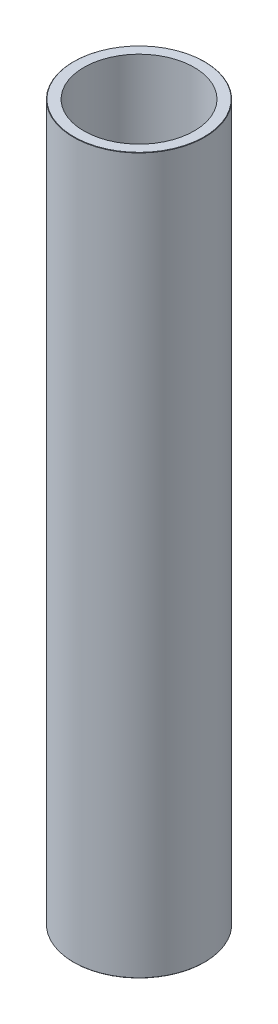
ISO-10303-21;
HEADER;
FILE_DESCRIPTION(('STEP AP214'),'2;1');
FILE_NAME('part.step','',(''),(''),'','','');
FILE_SCHEMA(('AUTOMOTIVE_DESIGN { 1 0 10303 214 1 1 1 1 }'));
ENDSEC;
DATA;
#1=APPLICATION_CONTEXT('core data for automotive mechanical design processes');
#2=APPLICATION_PROTOCOL_DEFINITION('international standard','automotive_design',2000,#1);
#3=PRODUCT_CONTEXT('',#1,'mechanical');
#4=PRODUCT('Part','Part','',(#3));
#5=PRODUCT_RELATED_PRODUCT_CATEGORY('part','',(#4));
#6=PRODUCT_DEFINITION_FORMATION('','',#4);
#7=PRODUCT_DEFINITION_CONTEXT('part definition',#1,'design');
#8=PRODUCT_DEFINITION('design','',#6,#7);
#9=PRODUCT_DEFINITION_SHAPE('','',#8);
#10=(LENGTH_UNIT() NAMED_UNIT(*) SI_UNIT(.MILLI.,.METRE.));
#11=(NAMED_UNIT(*) PLANE_ANGLE_UNIT() SI_UNIT($,.RADIAN.));
#12=(NAMED_UNIT(*) SI_UNIT($,.STERADIAN.) SOLID_ANGLE_UNIT());
#13=UNCERTAINTY_MEASURE_WITH_UNIT(LENGTH_MEASURE(1.E-05),#10,'distance_accuracy_value','');
#14=(GEOMETRIC_REPRESENTATION_CONTEXT(3) GLOBAL_UNCERTAINTY_ASSIGNED_CONTEXT((#13)) GLOBAL_UNIT_ASSIGNED_CONTEXT((#10,
#11,#12)) REPRESENTATION_CONTEXT('',''));
#15=CARTESIAN_POINT('',(0.,0.,0.));
#16=DIRECTION('',(0.,0.,1.));
#17=DIRECTION('',(1.,0.,0.));
#18=AXIS2_PLACEMENT_3D('',#15,#16,#17);
#19=CARTESIAN_POINT('',(0.,600.,0.));
#20=DIRECTION('',(0.,-1.,0.));
#21=DIRECTION('',(0.,0.,-1.));
#22=AXIS2_PLACEMENT_3D('',#19,#20,#21);
#23=CYLINDRICAL_SURFACE('',#22,55.);
#24=CARTESIAN_POINT('',(0.,599.766328907678,0.));
#25=DIRECTION('',(0.,1.,0.));
#26=DIRECTION('',(0.,0.,1.));
#27=AXIS2_PLACEMENT_3D('',#24,#25,#26);
#28=CIRCLE('',#27,55.);
#29=CARTESIAN_POINT('',(0.,599.766328907678,-55.0000000000001));
#30=VERTEX_POINT('',#29);
#31=EDGE_CURVE('E50',#30,#30,#28,.F.);
#32=ORIENTED_EDGE('',*,*,#31,.T.);
#33=EDGE_LOOP('',(#32));
#34=FACE_BOUND('',#33,.T.);
#35=CARTESIAN_POINT('',(0.,0.307946686866845,0.));
#36=DIRECTION('',(0.,1.,0.));
#37=DIRECTION('',(0.,0.,1.));
#38=AXIS2_PLACEMENT_3D('',#35,#36,#37);
#39=CIRCLE('',#38,55.);
#40=CARTESIAN_POINT('',(0.,0.307946686866845,55.));
#41=VERTEX_POINT('',#40);
#42=EDGE_CURVE('E51',#41,#41,#39,.T.);
#43=ORIENTED_EDGE('',*,*,#42,.T.);
#44=EDGE_LOOP('',(#43));
#45=FACE_BOUND('',#44,.T.);
#46=ADVANCED_FACE('F39',(#34,#45),#23,.T.);
#47=CARTESIAN_POINT('',(0.,600.,0.));
#48=DIRECTION('',(0.,1.,0.));
#49=DIRECTION('',(0.,0.,1.));
#50=AXIS2_PLACEMENT_3D('',#47,#48,#49);
#51=PLANE('',#50);
#52=CARTESIAN_POINT('',(0.,600.,0.));
#53=DIRECTION('',(0.,1.,0.));
#54=DIRECTION('',(0.,0.,1.));
#55=AXIS2_PLACEMENT_3D('',#52,#53,#54);
#56=CIRCLE('',#55,54.6920533131335);
#57=CARTESIAN_POINT('',(0.,600.,-54.6920533131335));
#58=VERTEX_POINT('',#57);
#59=EDGE_CURVE('E54',#58,#58,#56,.T.);
#60=ORIENTED_EDGE('',*,*,#59,.T.);
#61=EDGE_LOOP('',(#60));
#62=FACE_BOUND('',#61,.T.);
#63=CARTESIAN_POINT('',(0.,600.,0.));
#64=DIRECTION('',(0.,1.,0.));
#65=DIRECTION('',(0.,0.,1.));
#66=AXIS2_PLACEMENT_3D('',#63,#64,#65);
#67=CIRCLE('',#66,46.2754086849416);
#68=CARTESIAN_POINT('',(0.,600.,46.2754086849416));
#69=VERTEX_POINT('',#68);
#70=EDGE_CURVE('E58',#69,#69,#67,.T.);
#71=ORIENTED_EDGE('',*,*,#70,.F.);
#72=EDGE_LOOP('',(#71));
#73=FACE_BOUND('',#72,.T.);
#74=ADVANCED_FACE('F69',(#62,#73),#51,.T.);
#75=CARTESIAN_POINT('',(0.,0.,0.));
#76=DIRECTION('',(0.,1.,0.));
#77=DIRECTION('',(0.,0.,1.));
#78=AXIS2_PLACEMENT_3D('',#75,#76,#77);
#79=PLANE('',#78);
#80=CARTESIAN_POINT('',(0.,0.,0.));
#81=DIRECTION('',(0.,1.,0.));
#82=DIRECTION('',(0.,0.,1.));
#83=AXIS2_PLACEMENT_3D('',#80,#81,#82);
#84=CIRCLE('',#83,54.7663289076783);
#85=CARTESIAN_POINT('',(0.,0.,54.7663289076783));
#86=VERTEX_POINT('',#85);
#87=EDGE_CURVE('E10',#86,#86,#84,.F.);
#88=ORIENTED_EDGE('',*,*,#87,.T.);
#89=EDGE_LOOP('',(#88));
#90=FACE_BOUND('',#89,.T.);
#91=CARTESIAN_POINT('',(0.,0.,0.));
#92=DIRECTION('',(0.,1.,0.));
#93=DIRECTION('',(0.,0.,1.));
#94=AXIS2_PLACEMENT_3D('',#91,#92,#93);
#95=CIRCLE('',#94,46.2754086849416);
#96=CARTESIAN_POINT('',(0.,0.,46.2754086849416));
#97=VERTEX_POINT('',#96);
#98=EDGE_CURVE('E63',#97,#97,#95,.T.);
#99=ORIENTED_EDGE('',*,*,#98,.T.);
#100=EDGE_LOOP('',(#99));
#101=FACE_BOUND('',#100,.T.);
#102=ADVANCED_FACE('F75',(#90,#101),#79,.F.);
#103=CARTESIAN_POINT('',(0.,600.,0.));
#104=DIRECTION('',(0.,-1.,0.));
#105=DIRECTION('',(0.,0.,-1.));
#106=AXIS2_PLACEMENT_3D('',#103,#104,#105);
#107=CYLINDRICAL_SURFACE('',#106,46.2754086849416);
#108=ORIENTED_EDGE('',*,*,#70,.T.);
#109=EDGE_LOOP('',(#108));
#110=FACE_BOUND('',#109,.T.);
#111=ORIENTED_EDGE('',*,*,#98,.F.);
#112=EDGE_LOOP('',(#111));
#113=FACE_BOUND('',#112,.T.);
#114=ADVANCED_FACE('F70',(#110,#113),#107,.F.);
#115=CARTESIAN_POINT('',(0.,600.,0.));
#116=DIRECTION('',(0.,-1.,0.));
#117=DIRECTION('',(0.,0.,-1.));
#118=AXIS2_PLACEMENT_3D('',#115,#116,#117);
#119=CONICAL_SURFACE('',#118,54.6920533131335,0.921684603990881);
#120=CARTESIAN_POINT('',(0.,599.766328907678,-55.0000000000001));
#121=CARTESIAN_POINT('',(0.,599.768762981557,-54.9967922220119));
#122=CARTESIAN_POINT('',(0.,599.771197055435,-54.9935844440237));
#123=CARTESIAN_POINT('',(0.,599.776065203192,-54.9871688880473));
#124=CARTESIAN_POINT('',(0.,599.77849927707,-54.9839611100591));
#125=CARTESIAN_POINT('',(0.,599.783367424827,-54.9775455540827));
#126=CARTESIAN_POINT('',(0.,599.785801498705,-54.9743377760945));
#127=CARTESIAN_POINT('',(0.,599.790669646462,-54.9679222201181));
#128=CARTESIAN_POINT('',(0.,599.79310372034,-54.9647144421299));
#129=CARTESIAN_POINT('',(0.,599.797971868097,-54.9582988861536));
#130=CARTESIAN_POINT('',(0.,599.800405941975,-54.9550911081654));
#131=CARTESIAN_POINT('',(0.,599.805274089732,-54.948675552189));
#132=CARTESIAN_POINT('',(0.,599.80770816361,-54.9454677742008));
#133=CARTESIAN_POINT('',(0.,599.812576311367,-54.9390522182244));
#134=CARTESIAN_POINT('',(0.,599.815010385245,-54.9358444402362));
#135=CARTESIAN_POINT('',(0.,599.819878533002,-54.9294288842598));
#136=CARTESIAN_POINT('',(0.,599.82231260688,-54.9262211062716));
#137=CARTESIAN_POINT('',(0.,599.827180754637,-54.9198055502953));
#138=CARTESIAN_POINT('',(0.,599.829614828515,-54.9165977723071));
#139=CARTESIAN_POINT('',(0.,599.834482976272,-54.9101822163307));
#140=CARTESIAN_POINT('',(0.,599.836917050151,-54.9069744383425));
#141=CARTESIAN_POINT('',(0.,599.841785197907,-54.9005588823661));
#142=CARTESIAN_POINT('',(0.,599.844219271786,-54.8973511043779));
#143=CARTESIAN_POINT('',(0.,599.849087419542,-54.8909355484015));
#144=CARTESIAN_POINT('',(0.,599.851521493421,-54.8877277704133));
#145=CARTESIAN_POINT('',(0.,599.856389641177,-54.8813122144369));
#146=CARTESIAN_POINT('',(0.,599.858823715056,-54.8781044364488));
#147=CARTESIAN_POINT('',(0.,599.863691862812,-54.8716888804724));
#148=CARTESIAN_POINT('',(0.,599.866125936691,-54.8684811024842));
#149=CARTESIAN_POINT('',(0.,599.870994084447,-54.8620655465078));
#150=CARTESIAN_POINT('',(0.,599.873428158326,-54.8588577685196));
#151=CARTESIAN_POINT('',(0.,599.878296306082,-54.8524422125432));
#152=CARTESIAN_POINT('',(0.,599.880730379961,-54.849234434555));
#153=CARTESIAN_POINT('',(0.,599.885598527718,-54.8428188785786));
#154=CARTESIAN_POINT('',(0.,599.888032601596,-54.8396111005904));
#155=CARTESIAN_POINT('',(0.,599.892900749353,-54.833195544614));
#156=CARTESIAN_POINT('',(0.,599.895334823231,-54.8299877666258));
#157=CARTESIAN_POINT('',(0.,599.900202970988,-54.8235722106495));
#158=CARTESIAN_POINT('',(0.,599.902637044866,-54.8203644326613));
#159=CARTESIAN_POINT('',(0.,599.907505192623,-54.8139488766849));
#160=CARTESIAN_POINT('',(0.,599.909939266501,-54.8107410986967));
#161=CARTESIAN_POINT('',(0.,599.914807414258,-54.8043255427203));
#162=CARTESIAN_POINT('',(0.,599.917241488136,-54.8011177647321));
#163=CARTESIAN_POINT('',(0.,599.922109635893,-54.7947022087557));
#164=CARTESIAN_POINT('',(0.,599.924543709771,-54.7914944307675));
#165=CARTESIAN_POINT('',(0.,599.929411857528,-54.7850788747911));
#166=CARTESIAN_POINT('',(0.,599.931845931406,-54.781871096803));
#167=CARTESIAN_POINT('',(0.,599.936714079163,-54.7754555408266));
#168=CARTESIAN_POINT('',(0.,599.939148153041,-54.7722477628384));
#169=CARTESIAN_POINT('',(0.,599.944016300798,-54.765832206862));
#170=CARTESIAN_POINT('',(0.,599.946450374676,-54.7626244288738));
#171=CARTESIAN_POINT('',(0.,599.951318522433,-54.7562088728974));
#172=CARTESIAN_POINT('',(0.,599.953752596311,-54.7530010949092));
#173=CARTESIAN_POINT('',(0.,599.958620744068,-54.7465855389328));
#174=CARTESIAN_POINT('',(0.,599.961054817946,-54.7433777609446));
#175=CARTESIAN_POINT('',(0.,599.965922965703,-54.7369622049683));
#176=CARTESIAN_POINT('',(0.,599.968357039581,-54.7337544269801));
#177=CARTESIAN_POINT('',(0.,599.973225187338,-54.7273388710037));
#178=CARTESIAN_POINT('',(0.,599.975659261216,-54.7241310930155));
#179=CARTESIAN_POINT('',(0.,599.980527408973,-54.7177155370391));
#180=CARTESIAN_POINT('',(0.,599.982961482851,-54.7145077590509));
#181=CARTESIAN_POINT('',(0.,599.987829630608,-54.7080922030745));
#182=CARTESIAN_POINT('',(0.,599.990263704486,-54.7048844250863));
#183=CARTESIAN_POINT('',(0.,599.995131852243,-54.6984688691099));
#184=CARTESIAN_POINT('',(0.,599.997565926122,-54.6952610911217));
#185=CARTESIAN_POINT('',(0.,600.,-54.6920533131335));
#186=B_SPLINE_CURVE_WITH_KNOTS('',3,(#120,#121,#122,#123,#124,#125,#126,#127,#128,#129,#130,
#131,#132,#133,#134,#135,#136,#137,#138,#139,#140,#141,#142,#143,#144,#145,#146,#147,#148,#149,
#150,#151,#152,#153,#154,#155,#156,#157,#158,#159,#160,#161,#162,#163,#164,#165,#166,#167,#168,
#169,#170,#171,#172,#173,#174,#175,#176,#177,#178,#179,#180,#181,#182,#183,#184,#185),
.UNSPECIFIED.,.F.,.F.,(4,2,2,2,2,2,2,2,2,2,2,2,2,2,2,2,2,2,2,2,2,2,2,2,2,2,2,2,2,2,2,2,4),(0.,
0.0120801902883469,0.0241603805766213,0.0362405708648956,0.0483207611531699,0.0604009514414442,
0.0724811417297185,0.0845613320180599,0.0966415223063342,0.108721712594609,0.120801902882883,
0.132882093171157,0.144962283459431,0.157042473747773,0.169122664036047,0.181202854324322,
0.193283044612596,0.205363234900876,0.21744342518915,0.229523615477424,0.241603805765766,
0.25368399605404,0.265764186342314,0.277844376630589,0.289924566918863,0.302004757207137,
0.314084947495479,0.326165137783753,0.338245328072027,0.350325518360302,0.362405708648576,
0.37448589893685,0.386566089225192),.UNSPECIFIED.);
#187=EDGE_CURVE('BSEAM81',#30,#58,#186,.T.);
#188=ORIENTED_EDGE('',*,*,#31,.F.);
#189=ORIENTED_EDGE('',*,*,#59,.F.);
#190=ORIENTED_EDGE('',*,*,#187,.T.);
#191=ORIENTED_EDGE('',*,*,#187,.F.);
#192=EDGE_LOOP('',(#188,#190,#189,#191));
#193=FACE_BOUND('',#192,.T.);
#194=ADVANCED_FACE('F81',(#193),#119,.T.);
#195=CARTESIAN_POINT('',(0.,0.307946686866845,0.));
#196=DIRECTION('',(0.,1.,0.));
#197=DIRECTION('',(0.,0.,1.));
#198=AXIS2_PLACEMENT_3D('',#195,#196,#197);
#199=CONICAL_SURFACE('',#198,55.,0.649111722803874);
#200=ORIENTED_EDGE('',*,*,#87,.F.);
#201=EDGE_LOOP('',(#200));
#202=FACE_BOUND('',#201,.T.);
#203=ORIENTED_EDGE('',*,*,#42,.F.);
#204=EDGE_LOOP('',(#203));
#205=FACE_BOUND('',#204,.T.);
#206=ADVANCED_FACE('F45',(#202,#205),#199,.T.);
#207=CLOSED_SHELL('',(#46,#74,#102,#114,#194,#206));
#208=MANIFOLD_SOLID_BREP('B2',#207);
#209=ADVANCED_BREP_SHAPE_REPRESENTATION('',(#18,#208),#14);
#210=SHAPE_DEFINITION_REPRESENTATION(#9,#209);
ENDSEC;
END-ISO-10303-21;
